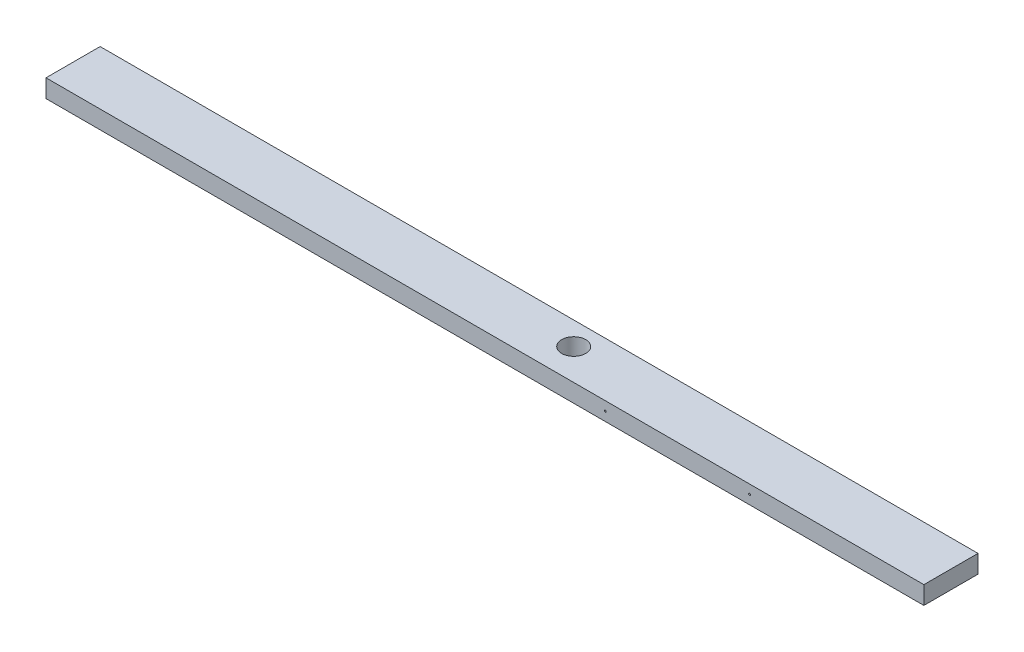
ISO-10303-21;
HEADER;
FILE_DESCRIPTION(('STEP AP214'),'2;1');
FILE_NAME('part.step','',(''),(''),'','','');
FILE_SCHEMA(('AUTOMOTIVE_DESIGN { 1 0 10303 214 1 1 1 1 }'));
ENDSEC;
DATA;
#1=APPLICATION_CONTEXT('core data for automotive mechanical design processes');
#2=APPLICATION_PROTOCOL_DEFINITION('international standard','automotive_design',2000,#1);
#3=PRODUCT_CONTEXT('',#1,'mechanical');
#4=PRODUCT('Part','Part','',(#3));
#5=PRODUCT_RELATED_PRODUCT_CATEGORY('part','',(#4));
#6=PRODUCT_DEFINITION_FORMATION('','',#4);
#7=PRODUCT_DEFINITION_CONTEXT('part definition',#1,'design');
#8=PRODUCT_DEFINITION('design','',#6,#7);
#9=PRODUCT_DEFINITION_SHAPE('','',#8);
#10=(LENGTH_UNIT() NAMED_UNIT(*) SI_UNIT(.MILLI.,.METRE.));
#11=(NAMED_UNIT(*) PLANE_ANGLE_UNIT() SI_UNIT($,.RADIAN.));
#12=(NAMED_UNIT(*) SI_UNIT($,.STERADIAN.) SOLID_ANGLE_UNIT());
#13=UNCERTAINTY_MEASURE_WITH_UNIT(LENGTH_MEASURE(1.E-05),#10,'distance_accuracy_value','');
#14=(GEOMETRIC_REPRESENTATION_CONTEXT(3) GLOBAL_UNCERTAINTY_ASSIGNED_CONTEXT((#13)) GLOBAL_UNIT_ASSIGNED_CONTEXT((#10,
#11,#12)) REPRESENTATION_CONTEXT('',''));
#15=CARTESIAN_POINT('',(0.,0.,0.));
#16=DIRECTION('',(0.,0.,1.));
#17=DIRECTION('',(1.,0.,0.));
#18=AXIS2_PLACEMENT_3D('',#15,#16,#17);
#19=CARTESIAN_POINT('',(-463.436215411197,5746.75,2683.51));
#20=DIRECTION('',(0.,-1.,0.));
#21=DIRECTION('',(0.,0.,-1.));
#22=AXIS2_PLACEMENT_3D('',#19,#20,#21);
#23=PLANE('',#22);
#24=CARTESIAN_POINT('',(60.8817848603334,5746.75,2707.80516042743));
#25=DIRECTION('',(0.,-1.,0.));
#26=DIRECTION('',(0.,0.,-1.));
#27=AXIS2_PLACEMENT_3D('',#24,#25,#26);
#28=CIRCLE('',#27,12.7);
#29=CARTESIAN_POINT('',(60.8817848603334,5746.75,2695.10516042743));
#30=VERTEX_POINT('',#29);
#31=EDGE_CURVE('E147',#30,#30,#28,.T.);
#32=ORIENTED_EDGE('',*,*,#31,.F.);
#33=EDGE_LOOP('',(#32));
#34=FACE_BOUND('',#33,.T.);
#35=DIRECTION('',(1.,0.,0.));
#36=VECTOR('',#35,1.);
#37=CARTESIAN_POINT('',(-5.68434188608079E-13,5746.75,2683.51));
#38=LINE('',#37,#36);
#39=CARTESIAN_POINT('',(-463.436215411197,5746.75,2683.51));
#40=VERTEX_POINT('',#39);
#41=CARTESIAN_POINT('',(463.436215411194,5746.75,2683.51));
#42=VERTEX_POINT('',#41);
#43=EDGE_CURVE('E204',#40,#42,#38,.T.);
#44=ORIENTED_EDGE('',*,*,#43,.T.);
#45=DIRECTION('',(0.,0.,-1.));
#46=VECTOR('',#45,1.);
#47=CARTESIAN_POINT('',(463.436215411194,5746.75,2683.51));
#48=LINE('',#47,#46);
#49=CARTESIAN_POINT('',(463.436215411194,5746.75,2740.66));
#50=VERTEX_POINT('',#49);
#51=EDGE_CURVE('E206',#50,#42,#48,.T.);
#52=ORIENTED_EDGE('',*,*,#51,.F.);
#53=DIRECTION('',(-1.,0.,0.));
#54=VECTOR('',#53,1.);
#55=CARTESIAN_POINT('',(-5.68434188608079E-13,5746.75,2740.66));
#56=LINE('',#55,#54);
#57=CARTESIAN_POINT('',(-463.436215411197,5746.75,2740.66));
#58=VERTEX_POINT('',#57);
#59=EDGE_CURVE('E98',#50,#58,#56,.T.);
#60=ORIENTED_EDGE('',*,*,#59,.T.);
#61=DIRECTION('',(0.,0.,1.));
#62=VECTOR('',#61,1.);
#63=CARTESIAN_POINT('',(-463.436215411197,5746.75,2683.51));
#64=LINE('',#63,#62);
#65=EDGE_CURVE('E195',#40,#58,#64,.T.);
#66=ORIENTED_EDGE('',*,*,#65,.F.);
#67=EDGE_LOOP('',(#44,#52,#60,#66));
#68=FACE_BOUND('',#67,.T.);
#69=ADVANCED_FACE('F49',(#34,#68),#23,.T.);
#70=CARTESIAN_POINT('',(-5.68434188608079E-13,5756.275,2740.66));
#71=DIRECTION('',(0.,0.,-1.));
#72=DIRECTION('',(-1.,0.,0.));
#73=AXIS2_PLACEMENT_3D('',#70,#71,#72);
#74=PLANE('',#73);
#75=CARTESIAN_POINT('',(127.000000000001,5756.275,2740.66));
#76=DIRECTION('',(0.,0.,-1.));
#77=DIRECTION('',(-1.,0.,0.));
#78=AXIS2_PLACEMENT_3D('',#75,#76,#77);
#79=CIRCLE('',#78,0.991870000000006);
#80=CARTESIAN_POINT('',(126.008130000001,5756.275,2740.66));
#81=VERTEX_POINT('',#80);
#82=EDGE_CURVE('E52',#81,#81,#79,.T.);
#83=ORIENTED_EDGE('',*,*,#82,.T.);
#84=EDGE_LOOP('',(#83));
#85=FACE_BOUND('',#84,.T.);
#86=CARTESIAN_POINT('',(279.400000000001,5756.275,2740.66));
#87=DIRECTION('',(0.,0.,-1.));
#88=DIRECTION('',(-1.,0.,0.));
#89=AXIS2_PLACEMENT_3D('',#86,#87,#88);
#90=CIRCLE('',#89,0.991870000000006);
#91=CARTESIAN_POINT('',(278.408130000001,5756.275,2740.66));
#92=VERTEX_POINT('',#91);
#93=EDGE_CURVE('E153',#92,#92,#90,.T.);
#94=ORIENTED_EDGE('',*,*,#93,.T.);
#95=EDGE_LOOP('',(#94));
#96=FACE_BOUND('',#95,.T.);
#97=DIRECTION('',(1.,0.,0.));
#98=VECTOR('',#97,1.);
#99=CARTESIAN_POINT('',(463.436215411194,5765.8,2740.66));
#100=LINE('',#99,#98);
#101=CARTESIAN_POINT('',(-463.436215411197,5765.8,2740.66));
#102=VERTEX_POINT('',#101);
#103=CARTESIAN_POINT('',(463.436215411194,5765.8,2740.66));
#104=VERTEX_POINT('',#103);
#105=EDGE_CURVE('E192',#102,#104,#100,.T.);
#106=ORIENTED_EDGE('',*,*,#105,.F.);
#107=DIRECTION('',(0.,1.,0.));
#108=VECTOR('',#107,1.);
#109=CARTESIAN_POINT('',(-463.436215411197,5765.8,2740.66));
#110=LINE('',#109,#108);
#111=EDGE_CURVE('E199',#58,#102,#110,.T.);
#112=ORIENTED_EDGE('',*,*,#111,.F.);
#113=ORIENTED_EDGE('',*,*,#59,.F.);
#114=DIRECTION('',(0.,1.,0.));
#115=VECTOR('',#114,1.);
#116=CARTESIAN_POINT('',(463.436215411194,5746.75,2740.66));
#117=LINE('',#116,#115);
#118=EDGE_CURVE('E209',#104,#50,#117,.F.);
#119=ORIENTED_EDGE('',*,*,#118,.F.);
#120=EDGE_LOOP('',(#106,#112,#113,#119));
#121=FACE_BOUND('',#120,.T.);
#122=ADVANCED_FACE('F282',(#85,#96,#121),#74,.F.);
#123=CARTESIAN_POINT('',(463.436215411194,5746.75,2683.51));
#124=DIRECTION('',(1.,0.,0.));
#125=DIRECTION('',(0.,0.,-1.));
#126=AXIS2_PLACEMENT_3D('',#123,#124,#125);
#127=PLANE('',#126);
#128=DIRECTION('',(0.,1.,0.));
#129=VECTOR('',#128,1.);
#130=CARTESIAN_POINT('',(463.436215411194,5756.275,2683.51));
#131=LINE('',#130,#129);
#132=CARTESIAN_POINT('',(463.436215411194,5765.8,2683.51));
#133=VERTEX_POINT('',#132);
#134=EDGE_CURVE('E202',#42,#133,#131,.T.);
#135=ORIENTED_EDGE('',*,*,#134,.T.);
#136=DIRECTION('',(0.,0.,1.));
#137=VECTOR('',#136,1.);
#138=CARTESIAN_POINT('',(463.436215411194,5765.8,2683.51));
#139=LINE('',#138,#137);
#140=EDGE_CURVE('E189',#104,#133,#139,.F.);
#141=ORIENTED_EDGE('',*,*,#140,.F.);
#142=ORIENTED_EDGE('',*,*,#118,.T.);
#143=ORIENTED_EDGE('',*,*,#51,.T.);
#144=EDGE_LOOP('',(#135,#141,#142,#143));
#145=FACE_BOUND('',#144,.T.);
#146=ADVANCED_FACE('F287',(#145),#127,.T.);
#147=CARTESIAN_POINT('',(-5.68434188608079E-13,5756.275,2683.51));
#148=DIRECTION('',(0.,0.,1.));
#149=DIRECTION('',(1.,0.,0.));
#150=AXIS2_PLACEMENT_3D('',#147,#148,#149);
#151=PLANE('',#150);
#152=CARTESIAN_POINT('',(406.562188157871,5756.275,2683.51));
#153=DIRECTION('',(0.,0.,1.));
#154=DIRECTION('',(1.,0.,0.));
#155=AXIS2_PLACEMENT_3D('',#152,#153,#154);
#156=CIRCLE('',#155,0.991870000000006);
#157=CARTESIAN_POINT('',(407.554058157871,5756.275,2683.51));
#158=VERTEX_POINT('',#157);
#159=EDGE_CURVE('E167',#158,#158,#156,.T.);
#160=ORIENTED_EDGE('',*,*,#159,.T.);
#161=EDGE_LOOP('',(#160));
#162=FACE_BOUND('',#161,.T.);
#163=CARTESIAN_POINT('',(203.362188157871,5756.275,2683.51));
#164=DIRECTION('',(0.,0.,1.));
#165=DIRECTION('',(1.,0.,0.));
#166=AXIS2_PLACEMENT_3D('',#163,#164,#165);
#167=CIRCLE('',#166,0.991870000000006);
#168=CARTESIAN_POINT('',(204.354058157871,5756.275,2683.51));
#169=VERTEX_POINT('',#168);
#170=EDGE_CURVE('E171',#169,#169,#167,.T.);
#171=ORIENTED_EDGE('',*,*,#170,.T.);
#172=EDGE_LOOP('',(#171));
#173=FACE_BOUND('',#172,.T.);
#174=CARTESIAN_POINT('',(-203.36218815787,5756.275,2683.51));
#175=DIRECTION('',(0.,0.,1.));
#176=DIRECTION('',(1.,0.,0.));
#177=AXIS2_PLACEMENT_3D('',#174,#175,#176);
#178=CIRCLE('',#177,0.991870000000006);
#179=CARTESIAN_POINT('',(-202.37031815787,5756.275,2683.51));
#180=VERTEX_POINT('',#179);
#181=EDGE_CURVE('E175',#180,#180,#178,.T.);
#182=ORIENTED_EDGE('',*,*,#181,.T.);
#183=EDGE_LOOP('',(#182));
#184=FACE_BOUND('',#183,.T.);
#185=CARTESIAN_POINT('',(-406.56218815787,5756.275,2683.51));
#186=DIRECTION('',(0.,0.,1.));
#187=DIRECTION('',(1.,0.,0.));
#188=AXIS2_PLACEMENT_3D('',#185,#186,#187);
#189=CIRCLE('',#188,0.991870000000006);
#190=CARTESIAN_POINT('',(-405.57031815787,5756.275,2683.51));
#191=VERTEX_POINT('',#190);
#192=EDGE_CURVE('E179',#191,#191,#189,.T.);
#193=ORIENTED_EDGE('',*,*,#192,.T.);
#194=EDGE_LOOP('',(#193));
#195=FACE_BOUND('',#194,.T.);
#196=CARTESIAN_POINT('',(0.162188157870948,5756.275,2683.51));
#197=DIRECTION('',(0.,0.,1.));
#198=DIRECTION('',(1.,0.,0.));
#199=AXIS2_PLACEMENT_3D('',#196,#197,#198);
#200=CIRCLE('',#199,0.991870000000001);
#201=CARTESIAN_POINT('',(2.43267862451435E-13,5755.29648014923,2683.51));
#202=VERTEX_POINT('',#201);
#203=CARTESIAN_POINT('',(2.43240757397123E-13,5757.25351985077,2683.51));
#204=VERTEX_POINT('',#203);
#205=EDGE_CURVE('E183',#202,#204,#200,.T.);
#206=ORIENTED_EDGE('',*,*,#205,.T.);
#207=CARTESIAN_POINT('',(-0.162188157870446,5756.275,2683.51));
#208=DIRECTION('',(0.,0.,1.));
#209=DIRECTION('',(1.,0.,0.));
#210=AXIS2_PLACEMENT_3D('',#207,#208,#209);
#211=CIRCLE('',#210,0.991870000000001);
#212=EDGE_CURVE('E158',#204,#202,#211,.T.);
#213=ORIENTED_EDGE('',*,*,#212,.T.);
#214=EDGE_LOOP('',(#206,#213));
#215=FACE_BOUND('',#214,.T.);
#216=ORIENTED_EDGE('',*,*,#134,.F.);
#217=ORIENTED_EDGE('',*,*,#43,.F.);
#218=DIRECTION('',(0.,1.,0.));
#219=VECTOR('',#218,1.);
#220=CARTESIAN_POINT('',(-463.436215411197,5765.8,2683.51));
#221=LINE('',#220,#219);
#222=CARTESIAN_POINT('',(-463.436215411197,5765.8,2683.51));
#223=VERTEX_POINT('',#222);
#224=EDGE_CURVE('E73',#223,#40,#221,.F.);
#225=ORIENTED_EDGE('',*,*,#224,.F.);
#226=DIRECTION('',(1.,0.,0.));
#227=VECTOR('',#226,1.);
#228=CARTESIAN_POINT('',(463.436215411194,5765.8,2683.51));
#229=LINE('',#228,#227);
#230=EDGE_CURVE('E186',#133,#223,#229,.F.);
#231=ORIENTED_EDGE('',*,*,#230,.F.);
#232=EDGE_LOOP('',(#216,#217,#225,#231));
#233=FACE_BOUND('',#232,.T.);
#234=ADVANCED_FACE('F296',(#162,#173,#184,#195,#215,#233),#151,.F.);
#235=CARTESIAN_POINT('',(-463.436215411197,5765.8,2683.51));
#236=DIRECTION('',(-1.,0.,0.));
#237=DIRECTION('',(0.,0.,1.));
#238=AXIS2_PLACEMENT_3D('',#235,#236,#237);
#239=PLANE('',#238);
#240=ORIENTED_EDGE('',*,*,#224,.T.);
#241=ORIENTED_EDGE('',*,*,#65,.T.);
#242=ORIENTED_EDGE('',*,*,#111,.T.);
#243=DIRECTION('',(0.,0.,1.));
#244=VECTOR('',#243,1.);
#245=CARTESIAN_POINT('',(-463.436215411197,5765.8,2683.51));
#246=LINE('',#245,#244);
#247=EDGE_CURVE('E57',#223,#102,#246,.T.);
#248=ORIENTED_EDGE('',*,*,#247,.F.);
#249=EDGE_LOOP('',(#240,#241,#242,#248));
#250=FACE_BOUND('',#249,.T.);
#251=ADVANCED_FACE('F278',(#250),#239,.T.);
#252=CARTESIAN_POINT('',(463.436215411194,5765.8,2683.51));
#253=DIRECTION('',(0.,1.,0.));
#254=DIRECTION('',(0.,0.,1.));
#255=AXIS2_PLACEMENT_3D('',#252,#253,#254);
#256=PLANE('',#255);
#257=CARTESIAN_POINT('',(60.8817848603334,5765.8,2707.80516042743));
#258=DIRECTION('',(0.,1.,0.));
#259=DIRECTION('',(0.,0.,1.));
#260=AXIS2_PLACEMENT_3D('',#257,#258,#259);
#261=CIRCLE('',#260,12.7);
#262=CARTESIAN_POINT('',(60.8817848603334,5765.8,2720.50516042743));
#263=VERTEX_POINT('',#262);
#264=EDGE_CURVE('E142',#263,#263,#261,.T.);
#265=ORIENTED_EDGE('',*,*,#264,.F.);
#266=EDGE_LOOP('',(#265));
#267=FACE_BOUND('',#266,.T.);
#268=ORIENTED_EDGE('',*,*,#230,.T.);
#269=ORIENTED_EDGE('',*,*,#247,.T.);
#270=ORIENTED_EDGE('',*,*,#105,.T.);
#271=ORIENTED_EDGE('',*,*,#140,.T.);
#272=EDGE_LOOP('',(#268,#269,#270,#271));
#273=FACE_BOUND('',#272,.T.);
#274=ADVANCED_FACE('F272',(#267,#273),#256,.T.);
#275=CARTESIAN_POINT('',(0.162188157870948,5756.275,2664.46));
#276=DIRECTION('',(0.,0.,-1.));
#277=DIRECTION('',(-1.,0.,0.));
#278=AXIS2_PLACEMENT_3D('',#275,#276,#277);
#279=CYLINDRICAL_SURFACE('',#278,0.991870000000001);
#280=CARTESIAN_POINT('',(0.162188157870948,5756.275,2702.56));
#281=DIRECTION('',(0.,0.,-1.));
#282=DIRECTION('',(-1.,0.,0.));
#283=AXIS2_PLACEMENT_3D('',#280,#281,#282);
#284=CIRCLE('',#283,0.99187);
#285=CARTESIAN_POINT('',(2.54435144828036E-13,5757.25351985077,2702.56));
#286=VERTEX_POINT('',#285);
#287=CARTESIAN_POINT('',(1.05606712610951E-12,5755.29648014923,2702.56));
#288=VERTEX_POINT('',#287);
#289=EDGE_CURVE('E180',#286,#288,#284,.T.);
#290=ORIENTED_EDGE('',*,*,#289,.F.);
#291=DIRECTION('',(0.,0.,-1.));
#292=VECTOR('',#291,1.);
#293=CARTESIAN_POINT('',(2.50911487767458E-13,5757.25351985077,2685.86142779831));
#294=LINE('',#293,#292);
#295=EDGE_CURVE('E161',#286,#204,#294,.T.);
#296=ORIENTED_EDGE('',*,*,#295,.T.);
#297=ORIENTED_EDGE('',*,*,#205,.F.);
#298=DIRECTION('',(0.,0.,-1.));
#299=VECTOR('',#298,1.);
#300=CARTESIAN_POINT('',(2.50911487767458E-13,5755.29648014923,2685.86142779831));
#301=LINE('',#300,#299);
#302=EDGE_CURVE('E155',#202,#288,#301,.F.);
#303=ORIENTED_EDGE('',*,*,#302,.T.);
#304=EDGE_LOOP('',(#290,#296,#297,#303));
#305=FACE_BOUND('',#304,.T.);
#306=ADVANCED_FACE('F270',(#305),#279,.F.);
#307=CARTESIAN_POINT('',(0.162188157870948,5756.275,2702.56));
#308=DIRECTION('',(0.,0.,-1.));
#309=DIRECTION('',(-1.,0.,0.));
#310=AXIS2_PLACEMENT_3D('',#307,#308,#309);
#311=CONICAL_SURFACE('',#310,0.99187,1.02974425867677);
#312=CARTESIAN_POINT('',(0.162188157870948,5756.275,2703.1559756222));
#313=VERTEX_POINT('',#312);
#314=VERTEX_LOOP('',#313);
#315=FACE_BOUND('',#314,.T.);
#316=ORIENTED_EDGE('',*,*,#289,.T.);
#317=CARTESIAN_POINT('',(2.51198937659147E-13,5755.29614275367,2702.5598));
#318=CARTESIAN_POINT('',(2.50777612684933E-13,5755.33622274437,2702.58355429892));
#319=CARTESIAN_POINT('',(2.50665200796683E-13,5755.3763163411,2702.60728575958));
#320=CARTESIAN_POINT('',(2.50659971459049E-13,5755.45655695675,2702.65466364106));
#321=CARTESIAN_POINT('',(2.50767167120648E-13,5755.49670397871,2702.67831005672));
#322=CARTESIAN_POINT('',(2.50802868422148E-13,5755.57705502762,2702.72546516481));
#323=CARTESIAN_POINT('',(2.50731453402914E-13,5755.61725902132,2702.74897391374));
#324=CARTESIAN_POINT('',(2.50660096685241E-13,5755.69779102663,2702.79577422433));
#325=CARTESIAN_POINT('',(2.50660152123758E-13,5755.73811903321,2702.81906579465));
#326=CARTESIAN_POINT('',(2.50656210398788E-13,5755.82106460029,2702.86645093902));
#327=CARTESIAN_POINT('',(2.50652005630406E-13,5755.86369368376,2702.89052453132));
#328=CARTESIAN_POINT('',(2.50652745892561E-13,5755.92806137032,2702.92591670622));
#329=CARTESIAN_POINT('',(2.50654169528605E-13,5755.94959809686,2702.9375996821));
#330=CARTESIAN_POINT('',(2.50656621368095E-13,5755.99288925361,2702.96054586712));
#331=CARTESIAN_POINT('',(2.50657649633641E-13,5756.01464364907,2702.97180914193));
#332=CARTESIAN_POINT('',(2.50658866901811E-13,5756.06062270023,2702.9946658445));
#333=CARTESIAN_POINT('',(2.50658966071314E-13,5756.08488436156,2703.00618754004));
#334=CARTESIAN_POINT('',(2.50658778706145E-13,5756.12190290502,2703.02206120864));
#335=CARTESIAN_POINT('',(2.50658660129618E-13,5756.1343512797,2703.02711916005));
#336=CARTESIAN_POINT('',(2.5065842215541E-13,5756.15952060852,2703.03649296374));
#337=CARTESIAN_POINT('',(2.50658302758102E-13,5756.17224144324,2703.04080913397));
#338=CARTESIAN_POINT('',(2.5065813479156E-13,5756.20220380472,2703.04953436198));
#339=CARTESIAN_POINT('',(2.50658121537235E-13,5756.21957884159,2703.05352346966));
#340=CARTESIAN_POINT('',(2.50658156295991E-13,5756.25467395206,2703.05827942006));
#341=CARTESIAN_POINT('',(2.50658203812561E-13,5756.27239007944,2703.05907215906));
#342=CARTESIAN_POINT('',(2.50658257057544E-13,5756.30759131259,2703.05714336611));
#343=CARTESIAN_POINT('',(2.50658262827162E-13,5756.32507662915,2703.0544253025));
#344=CARTESIAN_POINT('',(2.50658257264482E-13,5756.35091150894,2703.04848691579));
#345=CARTESIAN_POINT('',(2.50658252981759E-13,5756.35950048932,2703.04618059559));
#346=CARTESIAN_POINT('',(2.50658242461319E-13,5756.37653527285,2703.04108629514));
#347=CARTESIAN_POINT('',(2.50658236223771E-13,5756.3849810883,2703.03829835648));
#348=CARTESIAN_POINT('',(2.50658217045343E-13,5756.41281247796,2703.0284473419));
#349=CARTESIAN_POINT('',(2.5065820613034E-13,5756.43191560191,2703.02060067521));
#350=CARTESIAN_POINT('',(2.50658188686771E-13,5756.46968713805,2703.00391271234));
#351=CARTESIAN_POINT('',(2.5065818216319E-13,5756.48835503305,2702.99507029906));
#352=CARTESIAN_POINT('',(2.50658172879658E-13,5756.52545905087,2702.97680047011));
#353=CARTESIAN_POINT('',(2.50658170129115E-13,5756.5438944811,2702.96737165307));
#354=CARTESIAN_POINT('',(2.50658167787381E-13,5756.58058679616,2702.94817151118));
#355=CARTESIAN_POINT('',(2.5065816819654E-13,5756.59884366098,2702.93840014851));
#356=CARTESIAN_POINT('',(2.50658173221218E-13,5756.65352986467,2702.90871536227));
#357=CARTESIAN_POINT('',(2.50658181650805E-13,5756.68978299838,2702.88847830949));
#358=CARTESIAN_POINT('',(2.50658203568241E-13,5756.76200490663,2702.8476360693));
#359=CARTESIAN_POINT('',(2.50658217048267E-13,5756.79797403348,2702.82703149775));
#360=CARTESIAN_POINT('',(2.50658243616678E-13,5756.86916112774,2702.78595303791));
#361=CARTESIAN_POINT('',(2.50658256707805E-13,5756.90438133848,2702.76548303961));
#362=CARTESIAN_POINT('',(2.50658277882683E-13,5756.97476200221,2702.72439908168));
#363=CARTESIAN_POINT('',(2.50658285963833E-13,5757.00992241471,2702.70378505284));
#364=CARTESIAN_POINT('',(2.50658292223648E-13,5757.07990738127,2702.66263687011));
#365=CARTESIAN_POINT('',(2.50658290481957E-13,5757.11473234976,2702.64210342082));
#366=CARTESIAN_POINT('',(2.5065827251159E-13,5757.18432759685,2702.60098607631));
#367=CARTESIAN_POINT('',(2.50658256290594E-13,5757.21909789467,2702.58040221361));
#368=CARTESIAN_POINT('',(2.50658230448199E-13,5757.25385724633,2702.5598));
#369=B_SPLINE_CURVE_WITH_KNOTS('',3,(#317,#318,#319,#320,#321,#322,#323,#324,#325,#326,#327,
#328,#329,#330,#331,#332,#333,#334,#335,#336,#337,#338,#339,#340,#341,#342,#343,#344,#345,#346,
#347,#348,#349,#350,#351,#352,#353,#354,#355,#356,#357,#358,#359,#360,#361,#362,#363,#364,#365,
#366,#367,#368),.UNSPECIFIED.,.F.,.F.,(4,2,2,2,2,2,2,2,2,2,2,2,2,2,2,2,2,2,2,2,2,2,2,2,2,4),(0.,
0.139771493548494,0.279551331961363,0.419269089633458,0.558981250333716,0.705845514991827,
0.77934631079064,0.852835557494534,0.933364696924705,0.973657807987741,1.01393360416637,
1.06721326693443,1.12006039156157,1.17285534820531,1.19952687356025,1.22619609643322,
1.28808498978336,1.35004401969277,1.41215727548654,1.47427741275867,1.59882711982816,
1.72318474945453,1.84539439466823,1.96766746701606,2.08895056205389,2.21016935394332),.UNSPECIFIED.);
#370=EDGE_CURVE('E13',#288,#286,#369,.T.);
#371=ORIENTED_EDGE('',*,*,#370,.T.);
#372=EDGE_LOOP('',(#316,#371));
#373=FACE_BOUND('',#372,.T.);
#374=ADVANCED_FACE('F228',(#315,#373),#311,.F.);
#375=CARTESIAN_POINT('',(-406.56218815787,5756.275,2664.46));
#376=DIRECTION('',(0.,0.,-1.));
#377=DIRECTION('',(-1.,0.,0.));
#378=AXIS2_PLACEMENT_3D('',#375,#376,#377);
#379=CYLINDRICAL_SURFACE('',#378,0.991870000000006);
#380=CARTESIAN_POINT('',(-406.56218815787,5756.275,2702.56));
#381=DIRECTION('',(0.,0.,-1.));
#382=DIRECTION('',(-1.,0.,0.));
#383=AXIS2_PLACEMENT_3D('',#380,#381,#382);
#384=CIRCLE('',#383,0.991870000000006);
#385=CARTESIAN_POINT('',(-407.55405815787,5756.275,2702.56));
#386=VERTEX_POINT('',#385);
#387=EDGE_CURVE('E176',#386,#386,#384,.T.);
#388=ORIENTED_EDGE('',*,*,#387,.F.);
#389=EDGE_LOOP('',(#388));
#390=FACE_BOUND('',#389,.T.);
#391=ORIENTED_EDGE('',*,*,#192,.F.);
#392=EDGE_LOOP('',(#391));
#393=FACE_BOUND('',#392,.T.);
#394=ADVANCED_FACE('F265',(#390,#393),#379,.F.);
#395=CARTESIAN_POINT('',(-406.56218815787,5756.275,2702.56));
#396=DIRECTION('',(0.,0.,-1.));
#397=DIRECTION('',(-1.,0.,0.));
#398=AXIS2_PLACEMENT_3D('',#395,#396,#397);
#399=CONICAL_SURFACE('',#398,0.991870000000006,1.02974425867677);
#400=CARTESIAN_POINT('',(-406.56218815787,5756.275,2703.1559756222));
#401=VERTEX_POINT('',#400);
#402=VERTEX_LOOP('',#401);
#403=FACE_BOUND('',#402,.T.);
#404=ORIENTED_EDGE('',*,*,#387,.T.);
#405=EDGE_LOOP('',(#404));
#406=FACE_BOUND('',#405,.T.);
#407=ADVANCED_FACE('F260',(#403,#406),#399,.F.);
#408=CARTESIAN_POINT('',(-203.36218815787,5756.275,2664.46));
#409=DIRECTION('',(0.,0.,-1.));
#410=DIRECTION('',(-1.,0.,0.));
#411=AXIS2_PLACEMENT_3D('',#408,#409,#410);
#412=CYLINDRICAL_SURFACE('',#411,0.991870000000006);
#413=CARTESIAN_POINT('',(-203.36218815787,5756.275,2702.56));
#414=DIRECTION('',(0.,0.,-1.));
#415=DIRECTION('',(-1.,0.,0.));
#416=AXIS2_PLACEMENT_3D('',#413,#414,#415);
#417=CIRCLE('',#416,0.991870000000006);
#418=CARTESIAN_POINT('',(-204.35405815787,5756.275,2702.56));
#419=VERTEX_POINT('',#418);
#420=EDGE_CURVE('E172',#419,#419,#417,.T.);
#421=ORIENTED_EDGE('',*,*,#420,.F.);
#422=EDGE_LOOP('',(#421));
#423=FACE_BOUND('',#422,.T.);
#424=ORIENTED_EDGE('',*,*,#181,.F.);
#425=EDGE_LOOP('',(#424));
#426=FACE_BOUND('',#425,.T.);
#427=ADVANCED_FACE('F257',(#423,#426),#412,.F.);
#428=CARTESIAN_POINT('',(-203.36218815787,5756.275,2702.56));
#429=DIRECTION('',(0.,0.,-1.));
#430=DIRECTION('',(-1.,0.,0.));
#431=AXIS2_PLACEMENT_3D('',#428,#429,#430);
#432=CONICAL_SURFACE('',#431,0.991870000000006,1.02974425867677);
#433=CARTESIAN_POINT('',(-203.36218815787,5756.275,2703.1559756222));
#434=VERTEX_POINT('',#433);
#435=VERTEX_LOOP('',#434);
#436=FACE_BOUND('',#435,.T.);
#437=ORIENTED_EDGE('',*,*,#420,.T.);
#438=EDGE_LOOP('',(#437));
#439=FACE_BOUND('',#438,.T.);
#440=ADVANCED_FACE('F252',(#436,#439),#432,.F.);
#441=CARTESIAN_POINT('',(203.362188157871,5756.275,2664.46));
#442=DIRECTION('',(0.,0.,-1.));
#443=DIRECTION('',(-1.,0.,0.));
#444=AXIS2_PLACEMENT_3D('',#441,#442,#443);
#445=CYLINDRICAL_SURFACE('',#444,0.991870000000006);
#446=CARTESIAN_POINT('',(203.362188157871,5756.275,2702.56));
#447=DIRECTION('',(0.,0.,-1.));
#448=DIRECTION('',(-1.,0.,0.));
#449=AXIS2_PLACEMENT_3D('',#446,#447,#448);
#450=CIRCLE('',#449,0.991870000000006);
#451=CARTESIAN_POINT('',(202.370318157871,5756.275,2702.56));
#452=VERTEX_POINT('',#451);
#453=EDGE_CURVE('E168',#452,#452,#450,.T.);
#454=ORIENTED_EDGE('',*,*,#453,.F.);
#455=EDGE_LOOP('',(#454));
#456=FACE_BOUND('',#455,.T.);
#457=ORIENTED_EDGE('',*,*,#170,.F.);
#458=EDGE_LOOP('',(#457));
#459=FACE_BOUND('',#458,.T.);
#460=ADVANCED_FACE('F249',(#456,#459),#445,.F.);
#461=CARTESIAN_POINT('',(203.362188157871,5756.275,2702.56));
#462=DIRECTION('',(0.,0.,-1.));
#463=DIRECTION('',(-1.,0.,0.));
#464=AXIS2_PLACEMENT_3D('',#461,#462,#463);
#465=CONICAL_SURFACE('',#464,0.991870000000006,1.02974425867677);
#466=CARTESIAN_POINT('',(203.362188157871,5756.275,2703.1559756222));
#467=VERTEX_POINT('',#466);
#468=VERTEX_LOOP('',#467);
#469=FACE_BOUND('',#468,.T.);
#470=ORIENTED_EDGE('',*,*,#453,.T.);
#471=EDGE_LOOP('',(#470));
#472=FACE_BOUND('',#471,.T.);
#473=ADVANCED_FACE('F244',(#469,#472),#465,.F.);
#474=CARTESIAN_POINT('',(406.562188157871,5756.275,2664.46));
#475=DIRECTION('',(0.,0.,-1.));
#476=DIRECTION('',(-1.,0.,0.));
#477=AXIS2_PLACEMENT_3D('',#474,#475,#476);
#478=CYLINDRICAL_SURFACE('',#477,0.991870000000006);
#479=CARTESIAN_POINT('',(406.562188157871,5756.275,2702.56));
#480=DIRECTION('',(0.,0.,-1.));
#481=DIRECTION('',(-1.,0.,0.));
#482=AXIS2_PLACEMENT_3D('',#479,#480,#481);
#483=CIRCLE('',#482,0.991870000000006);
#484=CARTESIAN_POINT('',(405.570318157871,5756.275,2702.56));
#485=VERTEX_POINT('',#484);
#486=EDGE_CURVE('E164',#485,#485,#483,.T.);
#487=ORIENTED_EDGE('',*,*,#486,.F.);
#488=EDGE_LOOP('',(#487));
#489=FACE_BOUND('',#488,.T.);
#490=ORIENTED_EDGE('',*,*,#159,.F.);
#491=EDGE_LOOP('',(#490));
#492=FACE_BOUND('',#491,.T.);
#493=ADVANCED_FACE('F241',(#489,#492),#478,.F.);
#494=CARTESIAN_POINT('',(406.562188157871,5756.275,2702.56));
#495=DIRECTION('',(0.,0.,-1.));
#496=DIRECTION('',(-1.,0.,0.));
#497=AXIS2_PLACEMENT_3D('',#494,#495,#496);
#498=CONICAL_SURFACE('',#497,0.991870000000006,1.02974425867677);
#499=CARTESIAN_POINT('',(406.562188157871,5756.275,2703.1559756222));
#500=VERTEX_POINT('',#499);
#501=VERTEX_LOOP('',#500);
#502=FACE_BOUND('',#501,.T.);
#503=ORIENTED_EDGE('',*,*,#486,.T.);
#504=EDGE_LOOP('',(#503));
#505=FACE_BOUND('',#504,.T.);
#506=ADVANCED_FACE('F238',(#502,#505),#498,.F.);
#507=CARTESIAN_POINT('',(-0.162188157870446,5756.275,2702.56));
#508=DIRECTION('',(0.,0.,-1.));
#509=DIRECTION('',(-1.,0.,0.));
#510=AXIS2_PLACEMENT_3D('',#507,#508,#509);
#511=CONICAL_SURFACE('',#510,0.99187,1.02974425867677);
#512=CARTESIAN_POINT('',(-0.162188157870446,5756.275,2703.1559756222));
#513=VERTEX_POINT('',#512);
#514=VERTEX_LOOP('',#513);
#515=FACE_BOUND('',#514,.T.);
#516=CARTESIAN_POINT('',(-0.162188157870446,5756.275,2702.56));
#517=DIRECTION('',(0.,0.,-1.));
#518=DIRECTION('',(-1.,0.,0.));
#519=AXIS2_PLACEMENT_3D('',#516,#517,#518);
#520=CIRCLE('',#519,0.99187);
#521=EDGE_CURVE('E64',#288,#286,#520,.T.);
#522=ORIENTED_EDGE('',*,*,#521,.T.);
#523=ORIENTED_EDGE('',*,*,#370,.F.);
#524=EDGE_LOOP('',(#522,#523));
#525=FACE_BOUND('',#524,.T.);
#526=ADVANCED_FACE('F232',(#515,#525),#511,.F.);
#527=CARTESIAN_POINT('',(-0.162188157870446,5756.275,2664.46));
#528=DIRECTION('',(0.,0.,-1.));
#529=DIRECTION('',(-1.,0.,0.));
#530=AXIS2_PLACEMENT_3D('',#527,#528,#529);
#531=CYLINDRICAL_SURFACE('',#530,0.991870000000001);
#532=ORIENTED_EDGE('',*,*,#521,.F.);
#533=ORIENTED_EDGE('',*,*,#302,.F.);
#534=ORIENTED_EDGE('',*,*,#212,.F.);
#535=ORIENTED_EDGE('',*,*,#295,.F.);
#536=EDGE_LOOP('',(#532,#533,#534,#535));
#537=FACE_BOUND('',#536,.T.);
#538=ADVANCED_FACE('F237',(#537),#531,.F.);
#539=CARTESIAN_POINT('',(279.400000000001,5756.275,2759.71000000001));
#540=DIRECTION('',(0.,0.,1.));
#541=DIRECTION('',(1.,0.,0.));
#542=AXIS2_PLACEMENT_3D('',#539,#540,#541);
#543=CYLINDRICAL_SURFACE('',#542,0.991870000000006);
#544=CARTESIAN_POINT('',(279.400000000001,5756.275,2721.61000000001));
#545=DIRECTION('',(0.,0.,1.));
#546=DIRECTION('',(1.,0.,0.));
#547=AXIS2_PLACEMENT_3D('',#544,#545,#546);
#548=CIRCLE('',#547,0.991870000000006);
#549=CARTESIAN_POINT('',(280.391870000001,5756.275,2721.61000000001));
#550=VERTEX_POINT('',#549);
#551=EDGE_CURVE('E145',#550,#550,#548,.T.);
#552=ORIENTED_EDGE('',*,*,#551,.F.);
#553=EDGE_LOOP('',(#552));
#554=FACE_BOUND('',#553,.T.);
#555=ORIENTED_EDGE('',*,*,#93,.F.);
#556=EDGE_LOOP('',(#555));
#557=FACE_BOUND('',#556,.T.);
#558=ADVANCED_FACE('F394',(#554,#557),#543,.F.);
#559=CARTESIAN_POINT('',(279.400000000001,5756.275,2721.61000000001));
#560=DIRECTION('',(0.,0.,1.));
#561=DIRECTION('',(1.,0.,0.));
#562=AXIS2_PLACEMENT_3D('',#559,#560,#561);
#563=CONICAL_SURFACE('',#562,0.991870000000006,1.02974425867677);
#564=CARTESIAN_POINT('',(279.400000000001,5756.275,2721.01402437781));
#565=VERTEX_POINT('',#564);
#566=VERTEX_LOOP('',#565);
#567=FACE_BOUND('',#566,.T.);
#568=ORIENTED_EDGE('',*,*,#551,.T.);
#569=EDGE_LOOP('',(#568));
#570=FACE_BOUND('',#569,.T.);
#571=ADVANCED_FACE('F407',(#567,#570),#563,.F.);
#572=CARTESIAN_POINT('',(127.000000000001,5756.275,2759.71000000001));
#573=DIRECTION('',(0.,0.,1.));
#574=DIRECTION('',(1.,0.,0.));
#575=AXIS2_PLACEMENT_3D('',#572,#573,#574);
#576=CYLINDRICAL_SURFACE('',#575,0.991870000000006);
#577=CARTESIAN_POINT('',(127.000000000001,5756.275,2721.61000000001));
#578=DIRECTION('',(0.,0.,1.));
#579=DIRECTION('',(1.,0.,0.));
#580=AXIS2_PLACEMENT_3D('',#577,#578,#579);
#581=CIRCLE('',#580,0.991870000000006);
#582=CARTESIAN_POINT('',(127.991870000001,5756.275,2721.61000000001));
#583=VERTEX_POINT('',#582);
#584=EDGE_CURVE('E140',#583,#583,#581,.T.);
#585=ORIENTED_EDGE('',*,*,#584,.F.);
#586=EDGE_LOOP('',(#585));
#587=FACE_BOUND('',#586,.T.);
#588=ORIENTED_EDGE('',*,*,#82,.F.);
#589=EDGE_LOOP('',(#588));
#590=FACE_BOUND('',#589,.T.);
#591=ADVANCED_FACE('F136',(#587,#590),#576,.F.);
#592=CARTESIAN_POINT('',(127.000000000001,5756.275,2721.61000000001));
#593=DIRECTION('',(0.,0.,1.));
#594=DIRECTION('',(1.,0.,0.));
#595=AXIS2_PLACEMENT_3D('',#592,#593,#594);
#596=CONICAL_SURFACE('',#595,0.991870000000006,1.02974425867677);
#597=CARTESIAN_POINT('',(127.000000000001,5756.275,2721.01402437781));
#598=VERTEX_POINT('',#597);
#599=VERTEX_LOOP('',#598);
#600=FACE_BOUND('',#599,.T.);
#601=ORIENTED_EDGE('',*,*,#584,.T.);
#602=EDGE_LOOP('',(#601));
#603=FACE_BOUND('',#602,.T.);
#604=ADVANCED_FACE('F132',(#600,#603),#596,.F.);
#605=CARTESIAN_POINT('',(60.8817848603334,5746.75,2707.80516042743));
#606=DIRECTION('',(0.,-1.,0.));
#607=DIRECTION('',(0.,0.,-1.));
#608=AXIS2_PLACEMENT_3D('',#605,#606,#607);
#609=CYLINDRICAL_SURFACE('',#608,12.7);
#610=ORIENTED_EDGE('',*,*,#31,.T.);
#611=EDGE_LOOP('',(#610));
#612=FACE_BOUND('',#611,.T.);
#613=ORIENTED_EDGE('',*,*,#264,.T.);
#614=EDGE_LOOP('',(#613));
#615=FACE_BOUND('',#614,.T.);
#616=ADVANCED_FACE('F135',(#612,#615),#609,.F.);
#617=CLOSED_SHELL('',(#69,#122,#146,#234,#251,#274,#306,#374,#394,#407,#427,#440,#460,#473,#493,
#506,#526,#538,#558,#571,#591,#604,#616));
#618=MANIFOLD_SOLID_BREP('B2',#617);
#619=ADVANCED_BREP_SHAPE_REPRESENTATION('',(#18,#618),#14);
#620=SHAPE_DEFINITION_REPRESENTATION(#9,#619);
ENDSEC;
END-ISO-10303-21;
